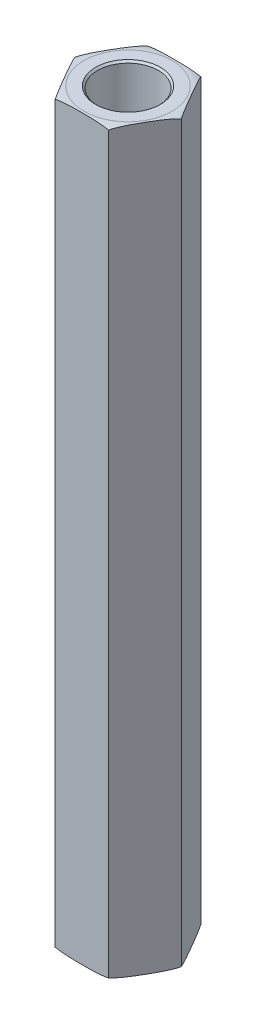
ISO-10303-21;
HEADER;
FILE_DESCRIPTION(('STEP AP214'),'2;1');
FILE_NAME('part.step','',(''),(''),'','','');
FILE_SCHEMA(('AUTOMOTIVE_DESIGN { 1 0 10303 214 1 1 1 1 }'));
ENDSEC;
DATA;
#1=APPLICATION_CONTEXT('core data for automotive mechanical design processes');
#2=APPLICATION_PROTOCOL_DEFINITION('international standard','automotive_design',2000,#1);
#3=PRODUCT_CONTEXT('',#1,'mechanical');
#4=PRODUCT('Part','Part','',(#3));
#5=PRODUCT_RELATED_PRODUCT_CATEGORY('part','',(#4));
#6=PRODUCT_DEFINITION_FORMATION('','',#4);
#7=PRODUCT_DEFINITION_CONTEXT('part definition',#1,'design');
#8=PRODUCT_DEFINITION('design','',#6,#7);
#9=PRODUCT_DEFINITION_SHAPE('','',#8);
#10=(LENGTH_UNIT() NAMED_UNIT(*) SI_UNIT(.MILLI.,.METRE.));
#11=(NAMED_UNIT(*) PLANE_ANGLE_UNIT() SI_UNIT($,.RADIAN.));
#12=(NAMED_UNIT(*) SI_UNIT($,.STERADIAN.) SOLID_ANGLE_UNIT());
#13=UNCERTAINTY_MEASURE_WITH_UNIT(LENGTH_MEASURE(1.E-05),#10,'distance_accuracy_value','');
#14=(GEOMETRIC_REPRESENTATION_CONTEXT(3) GLOBAL_UNCERTAINTY_ASSIGNED_CONTEXT((#13)) GLOBAL_UNIT_ASSIGNED_CONTEXT((#10,
#11,#12)) REPRESENTATION_CONTEXT('',''));
#15=CARTESIAN_POINT('',(0.,0.,0.));
#16=DIRECTION('',(0.,0.,1.));
#17=DIRECTION('',(1.,0.,0.));
#18=AXIS2_PLACEMENT_3D('',#15,#16,#17);
#19=CARTESIAN_POINT('',(0.,12.7,0.));
#20=DIRECTION('',(0.,1.,0.));
#21=DIRECTION('',(0.,0.,1.));
#22=AXIS2_PLACEMENT_3D('',#19,#20,#21);
#23=PLANE('',#22);
#24=CARTESIAN_POINT('',(0.,12.7,0.));
#25=DIRECTION('',(0.,1.,0.));
#26=DIRECTION('',(0.,0.,1.));
#27=AXIS2_PLACEMENT_3D('',#24,#25,#26);
#28=CIRCLE('',#27,2.0955);
#29=CARTESIAN_POINT('',(0.,12.7,2.0955));
#30=VERTEX_POINT('',#29);
#31=EDGE_CURVE('E314',#30,#30,#28,.T.);
#32=ORIENTED_EDGE('',*,*,#31,.T.);
#33=EDGE_LOOP('',(#32));
#34=FACE_BOUND('',#33,.T.);
#35=ADVANCED_FACE('F16',(#34),#23,.T.);
#36=CARTESIAN_POINT('',(0.,-12.7,0.));
#37=DIRECTION('',(0.,-1.,0.));
#38=DIRECTION('',(0.,0.,-1.));
#39=AXIS2_PLACEMENT_3D('',#36,#37,#38);
#40=PLANE('',#39);
#41=CARTESIAN_POINT('',(0.,-12.7,0.));
#42=DIRECTION('',(0.,-1.,0.));
#43=DIRECTION('',(0.,0.,-1.));
#44=AXIS2_PLACEMENT_3D('',#41,#42,#43);
#45=CIRCLE('',#44,2.0955);
#46=CARTESIAN_POINT('',(0.,-12.7,-2.0955));
#47=VERTEX_POINT('',#46);
#48=EDGE_CURVE('E324',#47,#47,#45,.T.);
#49=ORIENTED_EDGE('',*,*,#48,.T.);
#50=EDGE_LOOP('',(#49));
#51=FACE_BOUND('',#50,.T.);
#52=ADVANCED_FACE('F425',(#51),#40,.T.);
#53=CARTESIAN_POINT('',(0.,12.7,0.));
#54=DIRECTION('',(0.,1.,0.));
#55=DIRECTION('',(0.,0.,1.));
#56=AXIS2_PLACEMENT_3D('',#53,#54,#55);
#57=CYLINDRICAL_SURFACE('',#56,2.0955);
#58=CARTESIAN_POINT('',(0.,25.2729999999701,0.));
#59=DIRECTION('',(0.,1.,0.));
#60=DIRECTION('',(0.,0.,1.));
#61=AXIS2_PLACEMENT_3D('',#58,#59,#60);
#62=CIRCLE('',#61,2.09549999993897);
#63=CARTESIAN_POINT('',(0.,25.2729999999701,2.09549999993897));
#64=VERTEX_POINT('',#63);
#65=EDGE_CURVE('E326',#64,#64,#62,.T.);
#66=ORIENTED_EDGE('',*,*,#65,.T.);
#67=EDGE_LOOP('',(#66));
#68=FACE_BOUND('',#67,.T.);
#69=ORIENTED_EDGE('',*,*,#31,.F.);
#70=EDGE_LOOP('',(#69));
#71=FACE_BOUND('',#70,.T.);
#72=ADVANCED_FACE('F336',(#68,#71),#57,.F.);
#73=CARTESIAN_POINT('',(0.,-12.7,0.));
#74=DIRECTION('',(0.,-1.,0.));
#75=DIRECTION('',(0.,0.,-1.));
#76=AXIS2_PLACEMENT_3D('',#73,#74,#75);
#77=CYLINDRICAL_SURFACE('',#76,2.0955);
#78=ORIENTED_EDGE('',*,*,#48,.F.);
#79=EDGE_LOOP('',(#78));
#80=FACE_BOUND('',#79,.T.);
#81=CARTESIAN_POINT('',(0.,-25.2729999999701,0.));
#82=DIRECTION('',(0.,-1.,0.));
#83=DIRECTION('',(0.,0.,-1.));
#84=AXIS2_PLACEMENT_3D('',#81,#82,#83);
#85=CIRCLE('',#84,2.09549999999581);
#86=CARTESIAN_POINT('',(0.,-25.2729999999701,-2.09549999999581));
#87=VERTEX_POINT('',#86);
#88=EDGE_CURVE('E157',#87,#87,#85,.T.);
#89=ORIENTED_EDGE('',*,*,#88,.T.);
#90=EDGE_LOOP('',(#89));
#91=FACE_BOUND('',#90,.T.);
#92=ADVANCED_FACE('F341',(#80,#91),#77,.F.);
#93=CARTESIAN_POINT('',(0.,25.3999999998769,0.));
#94=DIRECTION('',(0.,1.,0.));
#95=DIRECTION('',(-1.,0.,0.));
#96=AXIS2_PLACEMENT_3D('',#93,#94,#95);
#97=CONICAL_SURFACE('',#96,2.2224999998457,0.785398163397448);
#98=CARTESIAN_POINT('',(0.,25.3999999999905,0.));
#99=DIRECTION('',(0.,1.,0.));
#100=DIRECTION('',(-1.,0.,0.));
#101=AXIS2_PLACEMENT_3D('',#98,#99,#100);
#102=CIRCLE('',#101,2.22249999995938);
#103=CARTESIAN_POINT('',(-2.22249999995938,25.3999999999905,0.));
#104=VERTEX_POINT('',#103);
#105=EDGE_CURVE('E79',#104,#104,#102,.T.);
#106=ORIENTED_EDGE('',*,*,#105,.T.);
#107=EDGE_LOOP('',(#106));
#108=FACE_BOUND('',#107,.T.);
#109=ORIENTED_EDGE('',*,*,#65,.F.);
#110=EDGE_LOOP('',(#109));
#111=FACE_BOUND('',#110,.T.);
#112=ADVANCED_FACE('F339',(#108,#111),#97,.F.);
#113=CARTESIAN_POINT('',(-3.66617420935413,25.4,0.));
#114=DIRECTION('',(0.866025403784439,0.,-0.499999999999999));
#115=DIRECTION('',(-0.499999999999999,0.,-0.866025403784439));
#116=AXIS2_PLACEMENT_3D('',#113,#114,#115);
#117=PLANE('',#116);
#118=DIRECTION('',(0.,1.,0.));
#119=VECTOR('',#118,1.);
#120=CARTESIAN_POINT('',(-1.83308710467708,25.4,3.175));
#121=LINE('',#120,#119);
#122=CARTESIAN_POINT('',(-1.83308710467707,-25.273,3.17499999999999));
#123=VERTEX_POINT('',#122);
#124=CARTESIAN_POINT('',(-1.83308710467706,25.273,3.175));
#125=VERTEX_POINT('',#124);
#126=EDGE_CURVE('E75',#123,#125,#121,.T.);
#127=ORIENTED_EDGE('',*,*,#126,.T.);
#128=CARTESIAN_POINT('',(-3.66617420935412,25.273,0.));
#129=CARTESIAN_POINT('',(-3.62797961467395,25.2889014148997,0.0661549785605581));
#130=CARTESIAN_POINT('',(-3.58956810864158,25.3024886076105,0.132685658603871));
#131=CARTESIAN_POINT('',(-3.51249051795712,25.3258161979402,0.266187961794345));
#132=CARTESIAN_POINT('',(-3.47382473049848,25.3355604771397,0.333159070187372));
#133=CARTESIAN_POINT('',(-3.39641631867875,25.3519966530451,0.467234372392355));
#134=CARTESIAN_POINT('',(-3.35767399633315,25.3586945328669,0.534338043098154));
#135=CARTESIAN_POINT('',(-3.28009834620116,25.3697767572932,0.668703010556943));
#136=CARTESIAN_POINT('',(-3.24126499587774,25.374160450474,0.735964346345226));
#137=CARTESIAN_POINT('',(-3.16354065964318,25.3812403004263,0.870586845688048));
#138=CARTESIAN_POINT('',(-3.1246496537448,25.3839355237591,0.937948043861515));
#139=CARTESIAN_POINT('',(-3.04685144594597,25.3881531983713,1.07269849250688));
#140=CARTESIAN_POINT('',(-3.00794424351974,25.3896756080272,1.14008774388949));
#141=CARTESIAN_POINT('',(-2.93051517598878,25.391922705889,1.27419882283578));
#142=CARTESIAN_POINT('',(-2.8919933624894,25.3926552468181,1.34092056101641));
#143=CARTESIAN_POINT('',(-2.81494778346149,25.3935767302574,1.4743674183913));
#144=CARTESIAN_POINT('',(-2.77642401791445,25.3937656658949,1.54109253761765));
#145=CARTESIAN_POINT('',(-2.69935964431019,25.3936659966806,1.67457194815371));
#146=CARTESIAN_POINT('',(-2.66081903631828,25.3933771811766,1.74132623935029));
#147=CARTESIAN_POINT('',(-2.58373908085337,25.392221986219,1.87483263846066));
#148=CARTESIAN_POINT('',(-2.54519973341253,25.3913555970386,1.94158474631875));
#149=CARTESIAN_POINT('',(-2.46812969629779,25.3887861940656,2.0750739663427));
#150=CARTESIAN_POINT('',(-2.42959900625973,25.3870832271617,2.1418110791393));
#151=CARTESIAN_POINT('',(-2.35255651340917,25.3824387229726,2.27525259109823));
#152=CARTESIAN_POINT('',(-2.31404470975451,25.3794972471358,2.34195699171921));
#153=CARTESIAN_POINT('',(-2.25084206239953,25.3732174124749,2.4514271881109));
#154=CARTESIAN_POINT('',(-2.22613849337018,25.3703980110463,2.49421502479802));
#155=CARTESIAN_POINT('',(-2.17676945272235,25.3638696794304,2.579724711521));
#156=CARTESIAN_POINT('',(-2.1521039703419,25.3601610809139,2.62244658019713));
#157=CARTESIAN_POINT('',(-2.10282753811702,25.3516802711497,2.70779586442636));
#158=CARTESIAN_POINT('',(-2.07821657107534,25.3469084657009,2.75042330976594));
#159=CARTESIAN_POINT('',(-2.02900094683554,25.3360987712516,2.83566727147549));
#160=CARTESIAN_POINT('',(-2.00439646085467,25.3300577313084,2.87828349128847));
#161=CARTESIAN_POINT('',(-1.95527325900936,25.3165138354161,2.96336737271501));
#162=CARTESIAN_POINT('',(-1.93075459617617,25.309010197803,3.00583494247576));
#163=CARTESIAN_POINT('',(-1.88182157373173,25.2923203507084,3.09058942351743));
#164=CARTESIAN_POINT('',(-1.85740744053271,25.2831314978033,3.13287594264089));
#165=CARTESIAN_POINT('',(-1.83308710467707,25.273,3.175));
#166=B_SPLINE_CURVE_WITH_KNOTS('',3,(#128,#129,#130,#131,#132,#133,#134,#135,#136,#137,#138,
#139,#140,#141,#142,#143,#144,#145,#146,#147,#148,#149,#150,#151,#152,#153,#154,#155,#156,#157,
#158,#159,#160,#161,#162,#163,#164,#165),.UNSPECIFIED.,.F.,.F.,(4,2,2,2,2,2,2,2,2,2,2,2,2,2,2,2,
2,2,4),(0.,0.233977307817926,0.467717675040663,0.700996973557454,0.934341903229689,
1.16781571967232,1.40129782179815,1.63243665809659,1.86357841666605,2.09482211846281,
2.3260697147148,2.55730435147381,2.78852751694395,2.93698369265072,3.08538458004461,
3.23372892334575,3.38244598546606,3.5312427462608,3.68027493713584),.UNSPECIFIED.);
#167=CARTESIAN_POINT('',(-3.66617420935412,25.273,0.));
#168=VERTEX_POINT('',#167);
#169=EDGE_CURVE('E68',#168,#125,#166,.T.);
#170=ORIENTED_EDGE('',*,*,#169,.F.);
#171=DIRECTION('',(0.,1.,0.));
#172=VECTOR('',#171,1.);
#173=CARTESIAN_POINT('',(-3.66617420935413,25.4,0.));
#174=LINE('',#173,#172);
#175=CARTESIAN_POINT('',(-3.66617420935413,-25.273,0.));
#176=VERTEX_POINT('',#175);
#177=EDGE_CURVE('E72',#168,#176,#174,.F.);
#178=ORIENTED_EDGE('',*,*,#177,.T.);
#179=CARTESIAN_POINT('',(-1.83308710467707,-25.273,3.17499999999999));
#180=CARTESIAN_POINT('',(-1.87128169935724,-25.2889014148997,3.10884502143944));
#181=CARTESIAN_POINT('',(-1.90969320538962,-25.3024886076105,3.04231434139612));
#182=CARTESIAN_POINT('',(-1.98677079607407,-25.3258161979402,2.90881203820565));
#183=CARTESIAN_POINT('',(-2.02543658353272,-25.3355604771397,2.84184092981262));
#184=CARTESIAN_POINT('',(-2.10284499535244,-25.3519966530451,2.70776562760764));
#185=CARTESIAN_POINT('',(-2.14158731769805,-25.3586945328669,2.64066195690184));
#186=CARTESIAN_POINT('',(-2.21916296783003,-25.3697767572932,2.50629698944305));
#187=CARTESIAN_POINT('',(-2.25799631815345,-25.374160450474,2.43903565365477));
#188=CARTESIAN_POINT('',(-2.33572065438801,-25.3812403004263,2.30441315431195));
#189=CARTESIAN_POINT('',(-2.3746116602864,-25.3839355237591,2.23705195613848));
#190=CARTESIAN_POINT('',(-2.45240986808522,-25.3881531983713,2.10230150749311));
#191=CARTESIAN_POINT('',(-2.49131707051146,-25.3896756080272,2.03491225611051));
#192=CARTESIAN_POINT('',(-2.56874613804241,-25.391922705889,1.90080117716421));
#193=CARTESIAN_POINT('',(-2.6072679515418,-25.3926552468181,1.83407943898358));
#194=CARTESIAN_POINT('',(-2.6843135305697,-25.3935767302574,1.70063258160869));
#195=CARTESIAN_POINT('',(-2.72283729611674,-25.3937656658949,1.63390746238234));
#196=CARTESIAN_POINT('',(-2.79990166972101,-25.3936659966806,1.50042805184629));
#197=CARTESIAN_POINT('',(-2.83844227771291,-25.3933771811766,1.43367376064971));
#198=CARTESIAN_POINT('',(-2.91552223317783,-25.392221986219,1.30016736153933));
#199=CARTESIAN_POINT('',(-2.95406158061867,-25.3913555970386,1.23341525368124));
#200=CARTESIAN_POINT('',(-3.03113161773341,-25.3887861940656,1.09992603365729));
#201=CARTESIAN_POINT('',(-3.06966230777146,-25.3870832271617,1.0331889208607));
#202=CARTESIAN_POINT('',(-3.14670480062202,-25.3824387229726,0.899747408901762));
#203=CARTESIAN_POINT('',(-3.18521660427668,-25.3794972471358,0.83304300828078));
#204=CARTESIAN_POINT('',(-3.24841925163166,-25.3732174124749,0.723572811889093));
#205=CARTESIAN_POINT('',(-3.27312282066101,-25.3703980110463,0.68078497520197));
#206=CARTESIAN_POINT('',(-3.32249186130884,-25.3638696794304,0.595275288478995));
#207=CARTESIAN_POINT('',(-3.34715734368929,-25.3601610809139,0.552553419802863));
#208=CARTESIAN_POINT('',(-3.39643377591418,-25.3516802711497,0.467204135573639));
#209=CARTESIAN_POINT('',(-3.42104474295585,-25.3469084657009,0.424576690234056));
#210=CARTESIAN_POINT('',(-3.47026036719565,-25.3360987712516,0.3393327285245));
#211=CARTESIAN_POINT('',(-3.49486485317652,-25.3300577313084,0.296716508711522));
#212=CARTESIAN_POINT('',(-3.54398805502183,-25.3165138354161,0.211632627284986));
#213=CARTESIAN_POINT('',(-3.56850671785503,-25.309010197803,0.169165057524237));
#214=CARTESIAN_POINT('',(-3.61743974029946,-25.2923203507084,0.0844105764825622));
#215=CARTESIAN_POINT('',(-3.64185387349848,-25.2831314978033,0.0421240573591058));
#216=CARTESIAN_POINT('',(-3.66617420935413,-25.273,0.));
#217=B_SPLINE_CURVE_WITH_KNOTS('',3,(#179,#180,#181,#182,#183,#184,#185,#186,#187,#188,#189,
#190,#191,#192,#193,#194,#195,#196,#197,#198,#199,#200,#201,#202,#203,#204,#205,#206,#207,#208,
#209,#210,#211,#212,#213,#214,#215,#216),.UNSPECIFIED.,.F.,.F.,(4,2,2,2,2,2,2,2,2,2,2,2,2,2,2,2,
2,2,4),(0.,0.233977307817926,0.467717675040663,0.700996973557454,0.934341903229688,
1.16781571967232,1.40129782179815,1.63243665809659,1.86357841666605,2.0948221184628,
2.3260697147148,2.55730435147381,2.78852751694395,2.93698369265072,3.08538458004461,
3.23372892334575,3.38244598546606,3.5312427462608,3.68027493713584),.UNSPECIFIED.);
#218=EDGE_CURVE('E87',#123,#176,#217,.T.);
#219=ORIENTED_EDGE('',*,*,#218,.F.);
#220=EDGE_LOOP('',(#127,#170,#178,#219));
#221=FACE_BOUND('',#220,.T.);
#222=ADVANCED_FACE('F70',(#221),#117,.F.);
#223=CARTESIAN_POINT('',(0.,-25.3999999998769,0.));
#224=DIRECTION('',(0.,-1.,0.));
#225=DIRECTION('',(1.,0.,0.));
#226=AXIS2_PLACEMENT_3D('',#223,#224,#225);
#227=CONICAL_SURFACE('',#226,2.22249999990254,0.785398163173655);
#228=ORIENTED_EDGE('',*,*,#88,.F.);
#229=EDGE_LOOP('',(#228));
#230=FACE_BOUND('',#229,.T.);
#231=CARTESIAN_POINT('',(0.,-25.3999999999337,0.));
#232=DIRECTION('',(0.,-1.,0.));
#233=DIRECTION('',(1.,0.,0.));
#234=AXIS2_PLACEMENT_3D('',#231,#232,#233);
#235=CIRCLE('',#234,2.22249999995938);
#236=CARTESIAN_POINT('',(2.22249999995938,-25.3999999999337,0.));
#237=VERTEX_POINT('',#236);
#238=EDGE_CURVE('E289',#237,#237,#235,.F.);
#239=ORIENTED_EDGE('',*,*,#238,.F.);
#240=EDGE_LOOP('',(#239));
#241=FACE_BOUND('',#240,.T.);
#242=ADVANCED_FACE('F348',(#230,#241),#227,.F.);
#243=CARTESIAN_POINT('',(-1.83308710467707,25.4,-3.175));
#244=DIRECTION('',(0.,-1.,0.));
#245=DIRECTION('',(0.,0.,-1.));
#246=AXIS2_PLACEMENT_3D('',#243,#244,#245);
#247=PLANE('',#246);
#248=CARTESIAN_POINT('',(0.,25.4,0.));
#249=DIRECTION('',(0.,-1.,0.));
#250=DIRECTION('',(0.,0.,1.));
#251=AXIS2_PLACEMENT_3D('',#248,#249,#250);
#252=CIRCLE('',#251,3.03117420935412);
#253=CARTESIAN_POINT('',(0.,25.4,3.03117420935412));
#254=VERTEX_POINT('',#253);
#255=CARTESIAN_POINT('',(0.,25.4,-3.03117420935412));
#256=VERTEX_POINT('',#255);
#257=EDGE_CURVE('E78',#254,#256,#252,.T.);
#258=ORIENTED_EDGE('',*,*,#257,.F.);
#259=CARTESIAN_POINT('',(0.,25.4,0.));
#260=DIRECTION('',(0.,-1.,0.));
#261=DIRECTION('',(0.,0.,-1.));
#262=AXIS2_PLACEMENT_3D('',#259,#260,#261);
#263=CIRCLE('',#262,3.03117420935412);
#264=EDGE_CURVE('E142',#256,#254,#263,.T.);
#265=ORIENTED_EDGE('',*,*,#264,.F.);
#266=EDGE_LOOP('',(#258,#265));
#267=FACE_BOUND('',#266,.T.);
#268=ORIENTED_EDGE('',*,*,#105,.F.);
#269=EDGE_LOOP('',(#268));
#270=FACE_BOUND('',#269,.T.);
#271=ADVANCED_FACE('F118',(#267,#270),#247,.F.);
#272=CARTESIAN_POINT('',(-1.83308710467707,25.4,-3.175));
#273=DIRECTION('',(0.866025403784439,0.,0.5));
#274=DIRECTION('',(0.5,0.,-0.866025403784439));
#275=AXIS2_PLACEMENT_3D('',#272,#273,#274);
#276=PLANE('',#275);
#277=ORIENTED_EDGE('',*,*,#177,.F.);
#278=CARTESIAN_POINT('',(-1.83308710467706,25.273,-3.17500000000001));
#279=CARTESIAN_POINT('',(-1.87128169935723,25.2889014148997,-3.10884502143946));
#280=CARTESIAN_POINT('',(-1.9096932053896,25.3024886076105,-3.04231434139615));
#281=CARTESIAN_POINT('',(-1.98677079607406,25.3258161979402,-2.90881203820568));
#282=CARTESIAN_POINT('',(-2.0254365835327,25.3355604771397,-2.84184092981265));
#283=CARTESIAN_POINT('',(-2.10284499535242,25.3519966530451,-2.70776562760767));
#284=CARTESIAN_POINT('',(-2.14158731769803,25.3586945328669,-2.64066195690188));
#285=CARTESIAN_POINT('',(-2.21916296783001,25.3697767572932,-2.50629698944309));
#286=CARTESIAN_POINT('',(-2.25799631815343,25.374160450474,-2.43903565365481));
#287=CARTESIAN_POINT('',(-2.33572065438799,25.3812403004263,-2.30441315431199));
#288=CARTESIAN_POINT('',(-2.37461166028637,25.3839355237591,-2.23705195613853));
#289=CARTESIAN_POINT('',(-2.45240986808519,25.3881531983713,-2.10230150749317));
#290=CARTESIAN_POINT('',(-2.49131707051143,25.3896756080272,-2.03491225611056));
#291=CARTESIAN_POINT('',(-2.56874613804238,25.391922705889,-1.90080117716427));
#292=CARTESIAN_POINT('',(-2.60726795154177,25.3926552468181,-1.83407943898364));
#293=CARTESIAN_POINT('',(-2.68431353056967,25.3935767302574,-1.70063258160875));
#294=CARTESIAN_POINT('',(-2.72283729611671,25.3937656658949,-1.63390746238241));
#295=CARTESIAN_POINT('',(-2.79990166972097,25.3936659966806,-1.50042805184636));
#296=CARTESIAN_POINT('',(-2.83844227771288,25.3933771811766,-1.43367376064978));
#297=CARTESIAN_POINT('',(-2.91552223317778,25.392221986219,-1.30016736153941));
#298=CARTESIAN_POINT('',(-2.95406158061863,25.3913555970386,-1.23341525368132));
#299=CARTESIAN_POINT('',(-3.03113161773337,25.3887861940656,-1.09992603365738));
#300=CARTESIAN_POINT('',(-3.06966230777142,25.3870832271617,-1.03318892086078));
#301=CARTESIAN_POINT('',(-3.14670480062198,25.3824387229726,-0.899747408901851));
#302=CARTESIAN_POINT('',(-3.18521660427663,25.3794972471358,-0.83304300828087));
#303=CARTESIAN_POINT('',(-3.24841925163161,25.3732174124749,-0.723572811889181));
#304=CARTESIAN_POINT('',(-3.27312282066097,25.3703980110463,-0.680784975202054));
#305=CARTESIAN_POINT('',(-3.32249186130881,25.3638696794304,-0.595275288479069));
#306=CARTESIAN_POINT('',(-3.34715734368926,25.3601610809139,-0.552553419802932));
#307=CARTESIAN_POINT('',(-3.39643377591415,25.3516802711497,-0.467204135573698));
#308=CARTESIAN_POINT('',(-3.42104474295582,25.3469084657009,-0.42457669023411));
#309=CARTESIAN_POINT('',(-3.47026036719563,25.3360987712516,-0.339332728524545));
#310=CARTESIAN_POINT('',(-3.4948648531765,25.3300577313084,-0.296716508711561));
#311=CARTESIAN_POINT('',(-3.54398805502182,25.3165138354161,-0.211632627285015));
#312=CARTESIAN_POINT('',(-3.56850671785502,25.309010197803,-0.169165057524262));
#313=CARTESIAN_POINT('',(-3.61743974029946,25.2923203507084,-0.0844105764825773));
#314=CARTESIAN_POINT('',(-3.64185387349848,25.2831314978033,-0.0421240573591159));
#315=CARTESIAN_POINT('',(-3.66617420935413,25.273,0.));
#316=B_SPLINE_CURVE_WITH_KNOTS('',3,(#278,#279,#280,#281,#282,#283,#284,#285,#286,#287,#288,
#289,#290,#291,#292,#293,#294,#295,#296,#297,#298,#299,#300,#301,#302,#303,#304,#305,#306,#307,
#308,#309,#310,#311,#312,#313,#314,#315),.UNSPECIFIED.,.F.,.F.,(4,2,2,2,2,2,2,2,2,2,2,2,2,2,2,2,
2,2,4),(0.,0.23397730781792,0.46771767504065,0.700996973557435,0.934341903229662,
1.16781571967229,1.40129782179811,1.63243665809654,1.86357841666599,2.09482211846275,
2.32606971471473,2.55730435147374,2.78852751694387,2.93698369265066,3.08538458004457,
3.23372892334572,3.38244598546605,3.53124274626081,3.68027493713587),.UNSPECIFIED.);
#317=CARTESIAN_POINT('',(-1.83308710467705,25.273,-3.17500000000001));
#318=VERTEX_POINT('',#317);
#319=EDGE_CURVE('E84',#318,#168,#316,.T.);
#320=ORIENTED_EDGE('',*,*,#319,.F.);
#321=DIRECTION('',(0.,1.,0.));
#322=VECTOR('',#321,1.);
#323=CARTESIAN_POINT('',(-1.83308710467704,25.4,-3.175));
#324=LINE('',#323,#322);
#325=CARTESIAN_POINT('',(-1.83308710467707,-25.273,-3.175));
#326=VERTEX_POINT('',#325);
#327=EDGE_CURVE('E180',#318,#326,#324,.F.);
#328=ORIENTED_EDGE('',*,*,#327,.T.);
#329=CARTESIAN_POINT('',(-3.66617420935413,-25.273,0.));
#330=CARTESIAN_POINT('',(-3.62797961467396,-25.2889014148997,-0.0661549785605592));
#331=CARTESIAN_POINT('',(-3.58956810864158,-25.3024886076105,-0.132685658603871));
#332=CARTESIAN_POINT('',(-3.51249051795713,-25.3258161979402,-0.266187961794346));
#333=CARTESIAN_POINT('',(-3.47382473049848,-25.3355604771397,-0.333159070187372));
#334=CARTESIAN_POINT('',(-3.39641631867876,-25.3519966530451,-0.467234372392354));
#335=CARTESIAN_POINT('',(-3.35767399633315,-25.3586945328669,-0.534338043098152));
#336=CARTESIAN_POINT('',(-3.28009834620117,-25.3697767572932,-0.66870301055694));
#337=CARTESIAN_POINT('',(-3.24126499587775,-25.374160450474,-0.735964346345222));
#338=CARTESIAN_POINT('',(-3.16354065964319,-25.3812403004263,-0.870586845688043));
#339=CARTESIAN_POINT('',(-3.1246496537448,-25.3839355237591,-0.937948043861509));
#340=CARTESIAN_POINT('',(-3.04685144594598,-25.3881531983713,-1.07269849250688));
#341=CARTESIAN_POINT('',(-3.00794424351975,-25.3896756080272,-1.14008774388948));
#342=CARTESIAN_POINT('',(-2.93051517598879,-25.391922705889,-1.27419882283578));
#343=CARTESIAN_POINT('',(-2.8919933624894,-25.3926552468181,-1.3409205610164));
#344=CARTESIAN_POINT('',(-2.8149477834615,-25.3935767302574,-1.4743674183913));
#345=CARTESIAN_POINT('',(-2.77642401791446,-25.3937656658949,-1.54109253761764));
#346=CARTESIAN_POINT('',(-2.6993596443102,-25.3936659966806,-1.6745719481537));
#347=CARTESIAN_POINT('',(-2.66081903631829,-25.3933771811766,-1.74132623935028));
#348=CARTESIAN_POINT('',(-2.58373908085338,-25.392221986219,-1.87483263846065));
#349=CARTESIAN_POINT('',(-2.54519973341254,-25.3913555970386,-1.94158474631874));
#350=CARTESIAN_POINT('',(-2.4681296962978,-25.3887861940656,-2.07507396634269));
#351=CARTESIAN_POINT('',(-2.42959900625974,-25.3870832271617,-2.14181107913928));
#352=CARTESIAN_POINT('',(-2.35255651340918,-25.3824387229726,-2.27525259109822));
#353=CARTESIAN_POINT('',(-2.31404470975452,-25.3794972471358,-2.3419569917192));
#354=CARTESIAN_POINT('',(-2.25084206239954,-25.3732174124749,-2.45142718811088));
#355=CARTESIAN_POINT('',(-2.22613849337019,-25.3703980110463,-2.49421502479801));
#356=CARTESIAN_POINT('',(-2.17676945272236,-25.3638696794304,-2.57972471152098));
#357=CARTESIAN_POINT('',(-2.15210397034191,-25.3601610809139,-2.62244658019712));
#358=CARTESIAN_POINT('',(-2.10282753811703,-25.3516802711497,-2.70779586442634));
#359=CARTESIAN_POINT('',(-2.07821657107535,-25.3469084657009,-2.75042330976592));
#360=CARTESIAN_POINT('',(-2.02900094683555,-25.3360987712516,-2.83566727147548));
#361=CARTESIAN_POINT('',(-2.00439646085468,-25.3300577313084,-2.87828349128846));
#362=CARTESIAN_POINT('',(-1.95527325900937,-25.3165138354161,-2.963367372715));
#363=CARTESIAN_POINT('',(-1.93075459617617,-25.309010197803,-3.00583494247575));
#364=CARTESIAN_POINT('',(-1.88182157373174,-25.2923203507084,-3.09058942351742));
#365=CARTESIAN_POINT('',(-1.85740744053272,-25.2831314978033,-3.13287594264088));
#366=CARTESIAN_POINT('',(-1.83308710467707,-25.273,-3.17499999999999));
#367=B_SPLINE_CURVE_WITH_KNOTS('',3,(#329,#330,#331,#332,#333,#334,#335,#336,#337,#338,#339,
#340,#341,#342,#343,#344,#345,#346,#347,#348,#349,#350,#351,#352,#353,#354,#355,#356,#357,#358,
#359,#360,#361,#362,#363,#364,#365,#366),.UNSPECIFIED.,.F.,.F.,(4,2,2,2,2,2,2,2,2,2,2,2,2,2,2,2,
2,2,4),(0.,0.233977307817925,0.467717675040661,0.700996973557449,0.934341903229682,
1.16781571967231,1.40129782179814,1.63243665809658,1.86357841666603,2.09482211846279,
2.32606971471478,2.55730435147379,2.78852751694393,2.9369836926507,3.0853845800446,
3.23372892334574,3.38244598546605,3.53124274626079,3.68027493713583),.UNSPECIFIED.);
#368=EDGE_CURVE('E86',#176,#326,#367,.T.);
#369=ORIENTED_EDGE('',*,*,#368,.F.);
#370=EDGE_LOOP('',(#277,#320,#328,#369));
#371=FACE_BOUND('',#370,.T.);
#372=ADVANCED_FACE('F82',(#371),#276,.F.);
#373=CARTESIAN_POINT('',(-1.83308710467707,25.4,3.175));
#374=DIRECTION('',(0.,0.,-1.));
#375=DIRECTION('',(-1.,0.,0.));
#376=AXIS2_PLACEMENT_3D('',#373,#374,#375);
#377=PLANE('',#376);
#378=DIRECTION('',(0.,1.,0.));
#379=VECTOR('',#378,1.);
#380=CARTESIAN_POINT('',(1.83308710467706,25.4,3.17499999999999));
#381=LINE('',#380,#379);
#382=CARTESIAN_POINT('',(1.83308710467706,-25.273,3.17499999999999));
#383=VERTEX_POINT('',#382);
#384=CARTESIAN_POINT('',(1.83308710467706,25.273,3.17499999999999));
#385=VERTEX_POINT('',#384);
#386=EDGE_CURVE('E182',#383,#385,#381,.T.);
#387=ORIENTED_EDGE('',*,*,#386,.T.);
#388=CARTESIAN_POINT('',(-1.83308710467706,25.273,3.175));
#389=CARTESIAN_POINT('',(-1.73237579828683,25.2939400141518,3.175));
#390=CARTESIAN_POINT('',(-1.63096506893486,25.3108853495327,3.175));
#391=CARTESIAN_POINT('',(-1.42767146651469,25.3384971643984,3.175));
#392=CARTESIAN_POINT('',(-1.32579191427254,25.3491875658753,3.175));
#393=CARTESIAN_POINT('',(-1.12177634709138,25.3661280408079,3.175));
#394=CARTESIAN_POINT('',(-1.0196405664338,25.3723812707189,3.175));
#395=CARTESIAN_POINT('',(-0.815663681397376,25.3819028064183,3.175));
#396=CARTESIAN_POINT('',(-0.713823115514574,25.3851834044999,3.175));
#397=CARTESIAN_POINT('',(-0.510018485441651,25.3899454848703,3.175));
#398=CARTESIAN_POINT('',(-0.408054390577977,25.3914254100882,3.175));
#399=CARTESIAN_POINT('',(-0.204060200337871,25.3933146818379,3.175));
#400=CARTESIAN_POINT('',(-0.102030100168935,25.3937234241492,3.175));
#401=CARTESIAN_POINT('',(0.102030100168936,25.3937234241492,3.175));
#402=CARTESIAN_POINT('',(0.204060200337871,25.3933146818379,3.175));
#403=CARTESIAN_POINT('',(0.408054390577978,25.3914254100882,3.17499999999999));
#404=CARTESIAN_POINT('',(0.510018485441653,25.3899454848703,3.17499999999999));
#405=CARTESIAN_POINT('',(0.713823115514575,25.3851834044999,3.17499999999999));
#406=CARTESIAN_POINT('',(0.815663681397378,25.3819028064183,3.17499999999999));
#407=CARTESIAN_POINT('',(1.0196405664338,25.3723812707189,3.17499999999999));
#408=CARTESIAN_POINT('',(1.12177634709138,25.3661280408079,3.17499999999999));
#409=CARTESIAN_POINT('',(1.32579191427254,25.3491875658753,3.17499999999999));
#410=CARTESIAN_POINT('',(1.42767146651469,25.3384971643984,3.17499999999999));
#411=CARTESIAN_POINT('',(1.63096506893486,25.3108853495327,3.17499999999999));
#412=CARTESIAN_POINT('',(1.73237579828684,25.2939400141518,3.17499999999999));
#413=CARTESIAN_POINT('',(1.83308710467706,25.273,3.17499999999999));
#414=B_SPLINE_CURVE_WITH_KNOTS('',3,(#388,#389,#390,#391,#392,#393,#394,#395,#396,#397,#398,
#399,#400,#401,#402,#403,#404,#405,#406,#407,#408,#409,#410,#411,#412,#413),.UNSPECIFIED.,.F.,
.F.,(4,2,2,2,2,2,2,2,2,2,2,2,4),(0.,0.308333242342808,0.615479423308236,0.92240689113001,
1.2280592962085,1.53397581645216,1.84006485747889,2.14615389850562,2.45207041874928,
2.75772282382777,3.06465029164954,3.37179647261497,3.68012971495778),.UNSPECIFIED.);
#415=EDGE_CURVE('E283',#125,#385,#414,.T.);
#416=ORIENTED_EDGE('',*,*,#415,.F.);
#417=ORIENTED_EDGE('',*,*,#126,.F.);
#418=CARTESIAN_POINT('',(1.83308710467706,-25.273,3.17499999999999));
#419=CARTESIAN_POINT('',(1.73237579828684,-25.2939400141518,3.17499999999999));
#420=CARTESIAN_POINT('',(1.63096506893486,-25.3108853495327,3.17499999999999));
#421=CARTESIAN_POINT('',(1.4276714665147,-25.3384971643984,3.17499999999999));
#422=CARTESIAN_POINT('',(1.32579191427254,-25.3491875658753,3.17499999999999));
#423=CARTESIAN_POINT('',(1.12177634709138,-25.3661280408079,3.17499999999999));
#424=CARTESIAN_POINT('',(1.0196405664338,-25.3723812707189,3.17499999999999));
#425=CARTESIAN_POINT('',(0.815663681397379,-25.3819028064183,3.17499999999999));
#426=CARTESIAN_POINT('',(0.713823115514576,-25.3851834044999,3.17499999999999));
#427=CARTESIAN_POINT('',(0.510018485441653,-25.3899454848703,3.17499999999999));
#428=CARTESIAN_POINT('',(0.408054390577978,-25.3914254100882,3.17499999999999));
#429=CARTESIAN_POINT('',(0.204060200337871,-25.3933146818379,3.175));
#430=CARTESIAN_POINT('',(0.102030100168936,-25.3937234241492,3.175));
#431=CARTESIAN_POINT('',(-0.102030100168936,-25.3937234241492,3.175));
#432=CARTESIAN_POINT('',(-0.204060200337872,-25.3933146818379,3.175));
#433=CARTESIAN_POINT('',(-0.408054390577981,-25.3914254100882,3.175));
#434=CARTESIAN_POINT('',(-0.510018485441656,-25.3899454848703,3.175));
#435=CARTESIAN_POINT('',(-0.71382311551458,-25.3851834044999,3.175));
#436=CARTESIAN_POINT('',(-0.815663681397384,-25.3819028064183,3.175));
#437=CARTESIAN_POINT('',(-1.01964056643381,-25.3723812707189,3.175));
#438=CARTESIAN_POINT('',(-1.12177634709139,-25.3661280408079,3.175));
#439=CARTESIAN_POINT('',(-1.32579191427255,-25.3491875658753,3.175));
#440=CARTESIAN_POINT('',(-1.4276714665147,-25.3384971643984,3.175));
#441=CARTESIAN_POINT('',(-1.63096506893487,-25.3108853495327,3.175));
#442=CARTESIAN_POINT('',(-1.73237579828685,-25.2939400141518,3.175));
#443=CARTESIAN_POINT('',(-1.83308710467708,-25.273,3.175));
#444=B_SPLINE_CURVE_WITH_KNOTS('',3,(#418,#419,#420,#421,#422,#423,#424,#425,#426,#427,#428,
#429,#430,#431,#432,#433,#434,#435,#436,#437,#438,#439,#440,#441,#442,#443),.UNSPECIFIED.,.F.,
.F.,(4,2,2,2,2,2,2,2,2,2,2,2,4),(0.,0.308333242342808,0.615479423308238,0.922406891130012,
1.22805929620851,1.53397581645217,1.84006485747889,2.14615389850562,2.45207041874929,
2.75772282382778,3.06465029164956,3.37179647261499,3.6801297149578),.UNSPECIFIED.);
#445=EDGE_CURVE('E255',#383,#123,#444,.T.);
#446=ORIENTED_EDGE('',*,*,#445,.F.);
#447=EDGE_LOOP('',(#387,#416,#417,#446));
#448=FACE_BOUND('',#447,.T.);
#449=ADVANCED_FACE('F206',(#448),#377,.F.);
#450=CARTESIAN_POINT('',(-1.83308710467707,-25.4,-3.175));
#451=DIRECTION('',(0.,-1.,0.));
#452=DIRECTION('',(0.,0.,-1.));
#453=AXIS2_PLACEMENT_3D('',#450,#451,#452);
#454=PLANE('',#453);
#455=CARTESIAN_POINT('',(0.,-25.4,0.));
#456=DIRECTION('',(0.,1.,0.));
#457=DIRECTION('',(0.,0.,1.));
#458=AXIS2_PLACEMENT_3D('',#455,#456,#457);
#459=CIRCLE('',#458,3.03117420935413);
#460=CARTESIAN_POINT('',(0.,-25.4,3.03117420935412));
#461=VERTEX_POINT('',#460);
#462=CARTESIAN_POINT('',(0.,-25.4,-3.03117420935412));
#463=VERTEX_POINT('',#462);
#464=EDGE_CURVE('E192',#461,#463,#459,.T.);
#465=ORIENTED_EDGE('',*,*,#464,.F.);
#466=CARTESIAN_POINT('',(0.,-25.4,0.));
#467=DIRECTION('',(0.,1.,0.));
#468=DIRECTION('',(0.,0.,-1.));
#469=AXIS2_PLACEMENT_3D('',#466,#467,#468);
#470=CIRCLE('',#469,3.03117420935413);
#471=EDGE_CURVE('E185',#461,#463,#470,.F.);
#472=ORIENTED_EDGE('',*,*,#471,.T.);
#473=EDGE_LOOP('',(#465,#472));
#474=FACE_BOUND('',#473,.T.);
#475=ORIENTED_EDGE('',*,*,#238,.T.);
#476=EDGE_LOOP('',(#475));
#477=FACE_BOUND('',#476,.T.);
#478=ADVANCED_FACE('F197',(#474,#477),#454,.T.);
#479=CARTESIAN_POINT('',(1.83308710467706,25.4,3.17499999999999));
#480=DIRECTION('',(-0.866025403784439,0.,-0.5));
#481=DIRECTION('',(-0.5,0.,0.866025403784439));
#482=AXIS2_PLACEMENT_3D('',#479,#480,#481);
#483=PLANE('',#482);
#484=DIRECTION('',(0.,1.,0.));
#485=VECTOR('',#484,1.);
#486=CARTESIAN_POINT('',(3.66617420935412,25.4,0.));
#487=LINE('',#486,#485);
#488=CARTESIAN_POINT('',(3.66617420935412,-25.273,0.));
#489=VERTEX_POINT('',#488);
#490=CARTESIAN_POINT('',(3.66617420935412,25.273,0.));
#491=VERTEX_POINT('',#490);
#492=EDGE_CURVE('E238',#489,#491,#487,.T.);
#493=ORIENTED_EDGE('',*,*,#492,.T.);
#494=CARTESIAN_POINT('',(1.83308710467706,25.273,3.17499999999999));
#495=CARTESIAN_POINT('',(1.87128169935723,25.2889014148997,3.10884502143944));
#496=CARTESIAN_POINT('',(1.90969320538961,25.3024886076105,3.04231434139613));
#497=CARTESIAN_POINT('',(1.98677079607406,25.3258161979402,2.90881203820565));
#498=CARTESIAN_POINT('',(2.02543658353271,25.3355604771397,2.84184092981262));
#499=CARTESIAN_POINT('',(2.10284499535243,25.3519966530451,2.70776562760764));
#500=CARTESIAN_POINT('',(2.14158731769804,25.3586945328669,2.64066195690184));
#501=CARTESIAN_POINT('',(2.21916296783003,25.3697767572932,2.50629698944305));
#502=CARTESIAN_POINT('',(2.25799631815344,25.374160450474,2.43903565365477));
#503=CARTESIAN_POINT('',(2.335720654388,25.3812403004263,2.30441315431195));
#504=CARTESIAN_POINT('',(2.37461166028639,25.3839355237591,2.23705195613848));
#505=CARTESIAN_POINT('',(2.45240986808522,25.3881531983713,2.10230150749311));
#506=CARTESIAN_POINT('',(2.49131707051145,25.3896756080272,2.03491225611051));
#507=CARTESIAN_POINT('',(2.56874613804241,25.391922705889,1.90080117716421));
#508=CARTESIAN_POINT('',(2.60726795154179,25.3926552468181,1.83407943898358));
#509=CARTESIAN_POINT('',(2.6843135305697,25.3935767302574,1.70063258160869));
#510=CARTESIAN_POINT('',(2.72283729611674,25.3937656658949,1.63390746238234));
#511=CARTESIAN_POINT('',(2.799901669721,25.3936659966806,1.50042805184629));
#512=CARTESIAN_POINT('',(2.83844227771291,25.3933771811766,1.43367376064971));
#513=CARTESIAN_POINT('',(2.91552223317782,25.392221986219,1.30016736153933));
#514=CARTESIAN_POINT('',(2.95406158061866,25.3913555970386,1.23341525368124));
#515=CARTESIAN_POINT('',(3.0311316177334,25.3887861940656,1.09992603365729));
#516=CARTESIAN_POINT('',(3.06966230777146,25.3870832271617,1.0331889208607));
#517=CARTESIAN_POINT('',(3.14670480062202,25.3824387229726,0.899747408901762));
#518=CARTESIAN_POINT('',(3.18521660427668,25.3794972471358,0.833043008280781));
#519=CARTESIAN_POINT('',(3.24841925163166,25.3732174124749,0.723572811889094));
#520=CARTESIAN_POINT('',(3.27312282066101,25.3703980110463,0.680784975201971));
#521=CARTESIAN_POINT('',(3.32249186130884,25.3638696794304,0.595275288478997));
#522=CARTESIAN_POINT('',(3.34715734368929,25.3601610809139,0.552553419802865));
#523=CARTESIAN_POINT('',(3.39643377591417,25.3516802711497,0.467204135573642));
#524=CARTESIAN_POINT('',(3.42104474295585,25.3469084657009,0.424576690234059));
#525=CARTESIAN_POINT('',(3.47026036719565,25.3360987712516,0.339332728524504));
#526=CARTESIAN_POINT('',(3.49486485317651,25.3300577313084,0.296716508711526));
#527=CARTESIAN_POINT('',(3.54398805502182,25.3165138354161,0.21163262728499));
#528=CARTESIAN_POINT('',(3.56850671785502,25.309010197803,0.169165057524242));
#529=CARTESIAN_POINT('',(3.61743974029946,25.2923203507084,0.0844105764825679));
#530=CARTESIAN_POINT('',(3.64185387349848,25.2831314978033,0.0421240573591117));
#531=CARTESIAN_POINT('',(3.66617420935412,25.273,0.));
#532=B_SPLINE_CURVE_WITH_KNOTS('',3,(#494,#495,#496,#497,#498,#499,#500,#501,#502,#503,#504,
#505,#506,#507,#508,#509,#510,#511,#512,#513,#514,#515,#516,#517,#518,#519,#520,#521,#522,#523,
#524,#525,#526,#527,#528,#529,#530,#531),.UNSPECIFIED.,.F.,.F.,(4,2,2,2,2,2,2,2,2,2,2,2,2,2,2,2,
2,2,4),(0.,0.233977307817927,0.467717675040665,0.700996973557455,0.93434190322969,
1.16781571967232,1.40129782179816,1.63243665809659,1.86357841666605,2.09482211846281,
2.3260697147148,2.55730435147382,2.78852751694395,2.93698369265073,3.08538458004462,
3.23372892334575,3.38244598546606,3.5312427462608,3.68027493713584),.UNSPECIFIED.);
#533=EDGE_CURVE('E277',#385,#491,#532,.T.);
#534=ORIENTED_EDGE('',*,*,#533,.F.);
#535=ORIENTED_EDGE('',*,*,#386,.F.);
#536=CARTESIAN_POINT('',(3.66617420935412,-25.273,0.));
#537=CARTESIAN_POINT('',(3.62797961467395,-25.2889014148997,0.0661549785605577));
#538=CARTESIAN_POINT('',(3.58956810864157,-25.3024886076105,0.13268565860387));
#539=CARTESIAN_POINT('',(3.51249051795712,-25.3258161979402,0.266187961794346));
#540=CARTESIAN_POINT('',(3.47382473049847,-25.3355604771397,0.333159070187373));
#541=CARTESIAN_POINT('',(3.39641631867875,-25.3519966530451,0.467234372392356));
#542=CARTESIAN_POINT('',(3.35767399633314,-25.3586945328669,0.534338043098155));
#543=CARTESIAN_POINT('',(3.28009834620116,-25.3697767572932,0.668703010556944));
#544=CARTESIAN_POINT('',(3.24126499587774,-25.374160450474,0.735964346345227));
#545=CARTESIAN_POINT('',(3.16354065964318,-25.3812403004263,0.870586845688049));
#546=CARTESIAN_POINT('',(3.12464965374479,-25.3839355237591,0.937948043861516));
#547=CARTESIAN_POINT('',(3.04685144594596,-25.3881531983713,1.07269849250688));
#548=CARTESIAN_POINT('',(3.00794424351973,-25.3896756080272,1.14008774388949));
#549=CARTESIAN_POINT('',(2.93051517598877,-25.391922705889,1.27419882283579));
#550=CARTESIAN_POINT('',(2.89199336248939,-25.3926552468181,1.34092056101641));
#551=CARTESIAN_POINT('',(2.81494778346149,-25.3935767302574,1.47436741839131));
#552=CARTESIAN_POINT('',(2.77642401791444,-25.3937656658949,1.54109253761766));
#553=CARTESIAN_POINT('',(2.69935964431018,-25.3936659966806,1.67457194815371));
#554=CARTESIAN_POINT('',(2.66081903631827,-25.3933771811766,1.74132623935029));
#555=CARTESIAN_POINT('',(2.58373908085336,-25.392221986219,1.87483263846066));
#556=CARTESIAN_POINT('',(2.54519973341252,-25.3913555970386,1.94158474631875));
#557=CARTESIAN_POINT('',(2.46812969629778,-25.3887861940656,2.0750739663427));
#558=CARTESIAN_POINT('',(2.42959900625972,-25.3870832271617,2.1418110791393));
#559=CARTESIAN_POINT('',(2.35255651340916,-25.3824387229726,2.27525259109824));
#560=CARTESIAN_POINT('',(2.3140447097545,-25.3794972471358,2.34195699171922));
#561=CARTESIAN_POINT('',(2.25084206239952,-25.3732174124749,2.45142718811091));
#562=CARTESIAN_POINT('',(2.22613849337017,-25.3703980110463,2.49421502479803));
#563=CARTESIAN_POINT('',(2.17676945272234,-25.3638696794304,2.579724711521));
#564=CARTESIAN_POINT('',(2.15210397034189,-25.3601610809139,2.62244658019713));
#565=CARTESIAN_POINT('',(2.10282753811701,-25.3516802711497,2.70779586442636));
#566=CARTESIAN_POINT('',(2.07821657107533,-25.3469084657009,2.75042330976594));
#567=CARTESIAN_POINT('',(2.02900094683553,-25.3360987712516,2.83566727147549));
#568=CARTESIAN_POINT('',(2.00439646085467,-25.3300577313084,2.87828349128847));
#569=CARTESIAN_POINT('',(1.95527325900936,-25.3165138354161,2.96336737271501));
#570=CARTESIAN_POINT('',(1.93075459617616,-25.309010197803,3.00583494247575));
#571=CARTESIAN_POINT('',(1.88182157373172,-25.2923203507084,3.09058942351743));
#572=CARTESIAN_POINT('',(1.8574074405327,-25.2831314978033,3.13287594264088));
#573=CARTESIAN_POINT('',(1.83308710467706,-25.273,3.17499999999999));
#574=B_SPLINE_CURVE_WITH_KNOTS('',3,(#536,#537,#538,#539,#540,#541,#542,#543,#544,#545,#546,
#547,#548,#549,#550,#551,#552,#553,#554,#555,#556,#557,#558,#559,#560,#561,#562,#563,#564,#565,
#566,#567,#568,#569,#570,#571,#572,#573),.UNSPECIFIED.,.F.,.F.,(4,2,2,2,2,2,2,2,2,2,2,2,2,2,2,2,
2,2,4),(0.,0.233977307817927,0.467717675040665,0.700996973557456,0.934341903229692,
1.16781571967232,1.40129782179816,1.63243665809659,1.86357841666605,2.09482211846281,
2.3260697147148,2.55730435147382,2.78852751694396,2.93698369265073,3.08538458004462,
3.23372892334575,3.38244598546606,3.5312427462608,3.68027493713584),.UNSPECIFIED.);
#575=EDGE_CURVE('E261',#489,#383,#574,.T.);
#576=ORIENTED_EDGE('',*,*,#575,.F.);
#577=EDGE_LOOP('',(#493,#534,#535,#576));
#578=FACE_BOUND('',#577,.T.);
#579=ADVANCED_FACE('F170',(#578),#483,.F.);
#580=CARTESIAN_POINT('',(0.,23.7490000000001,0.));
#581=DIRECTION('',(0.,1.,0.));
#582=DIRECTION('',(0.,0.,1.));
#583=AXIS2_PLACEMENT_3D('',#580,#581,#582);
#584=TOROIDAL_SURFACE('',#583,3.03117420935414,1.65099999999989);
#585=ORIENTED_EDGE('',*,*,#257,.T.);
#586=ORIENTED_EDGE('',*,*,#264,.T.);
#587=EDGE_LOOP('',(#585,#586));
#588=FACE_BOUND('',#587,.T.);
#589=ORIENTED_EDGE('',*,*,#533,.T.);
#590=CARTESIAN_POINT('',(3.66617420935412,25.273,0.));
#591=CARTESIAN_POINT('',(3.62797961467395,25.2889014148997,-0.0661549785605518));
#592=CARTESIAN_POINT('',(3.58956810864157,25.3024886076105,-0.132685658603865));
#593=CARTESIAN_POINT('',(3.51249051795712,25.3258161979402,-0.26618796179434));
#594=CARTESIAN_POINT('',(3.47382473049848,25.3355604771397,-0.333159070187367));
#595=CARTESIAN_POINT('',(3.39641631867875,25.3519966530451,-0.46723437239235));
#596=CARTESIAN_POINT('',(3.35767399633314,25.3586945328669,-0.534338043098149));
#597=CARTESIAN_POINT('',(3.28009834620116,25.3697767572932,-0.668703010556938));
#598=CARTESIAN_POINT('',(3.24126499587774,25.374160450474,-0.735964346345221));
#599=CARTESIAN_POINT('',(3.16354065964318,25.3812403004263,-0.870586845688042));
#600=CARTESIAN_POINT('',(3.12464965374479,25.3839355237591,-0.937948043861509));
#601=CARTESIAN_POINT('',(3.04685144594597,25.3881531983713,-1.07269849250688));
#602=CARTESIAN_POINT('',(3.00794424351973,25.3896756080272,-1.14008774388948));
#603=CARTESIAN_POINT('',(2.93051517598878,25.391922705889,-1.27419882283578));
#604=CARTESIAN_POINT('',(2.89199336248939,25.3926552468181,-1.34092056101641));
#605=CARTESIAN_POINT('',(2.81494778346149,25.3935767302574,-1.4743674183913));
#606=CARTESIAN_POINT('',(2.77642401791445,25.3937656658949,-1.54109253761765));
#607=CARTESIAN_POINT('',(2.69935964431018,25.3936659966806,-1.6745719481537));
#608=CARTESIAN_POINT('',(2.66081903631827,25.3933771811766,-1.74132623935028));
#609=CARTESIAN_POINT('',(2.58373908085336,25.392221986219,-1.87483263846065));
#610=CARTESIAN_POINT('',(2.54519973341252,25.3913555970386,-1.94158474631874));
#611=CARTESIAN_POINT('',(2.46812969629778,25.3887861940656,-2.07507396634269));
#612=CARTESIAN_POINT('',(2.42959900625973,25.3870832271617,-2.14181107913929));
#613=CARTESIAN_POINT('',(2.35255651340916,25.3824387229726,-2.27525259109823));
#614=CARTESIAN_POINT('',(2.31404470975451,25.3794972471358,-2.34195699171921));
#615=CARTESIAN_POINT('',(2.25084206239952,25.3732174124749,-2.45142718811089));
#616=CARTESIAN_POINT('',(2.22613849337017,25.3703980110463,-2.49421502479802));
#617=CARTESIAN_POINT('',(2.17676945272234,25.3638696794304,-2.579724711521));
#618=CARTESIAN_POINT('',(2.15210397034189,25.3601610809139,-2.62244658019713));
#619=CARTESIAN_POINT('',(2.10282753811701,25.3516802711497,-2.70779586442635));
#620=CARTESIAN_POINT('',(2.07821657107533,25.3469084657009,-2.75042330976594));
#621=CARTESIAN_POINT('',(2.02900094683553,25.3360987712516,-2.83566727147549));
#622=CARTESIAN_POINT('',(2.00439646085466,25.3300577313084,-2.87828349128847));
#623=CARTESIAN_POINT('',(1.95527325900935,25.3165138354161,-2.96336737271501));
#624=CARTESIAN_POINT('',(1.93075459617616,25.309010197803,-3.00583494247576));
#625=CARTESIAN_POINT('',(1.88182157373172,25.2923203507084,-3.09058942351744));
#626=CARTESIAN_POINT('',(1.8574074405327,25.2831314978033,-3.13287594264089));
#627=CARTESIAN_POINT('',(1.83308710467706,25.273,-3.175));
#628=B_SPLINE_CURVE_WITH_KNOTS('',3,(#590,#591,#592,#593,#594,#595,#596,#597,#598,#599,#600,
#601,#602,#603,#604,#605,#606,#607,#608,#609,#610,#611,#612,#613,#614,#615,#616,#617,#618,#619,
#620,#621,#622,#623,#624,#625,#626,#627),.UNSPECIFIED.,.F.,.F.,(4,2,2,2,2,2,2,2,2,2,2,2,2,2,2,2,
2,2,4),(0.,0.233977307817927,0.467717675040664,0.700996973557455,0.93434190322969,
1.16781571967232,1.40129782179815,1.63243665809659,1.86357841666605,2.09482211846281,
2.3260697147148,2.55730435147381,2.78852751694395,2.93698369265072,3.08538458004462,
3.23372892334576,3.38244598546607,3.53124274626082,3.68027493713586),.UNSPECIFIED.);
#629=CARTESIAN_POINT('',(1.83308710467706,25.273,-3.175));
#630=VERTEX_POINT('',#629);
#631=EDGE_CURVE('E241',#491,#630,#628,.T.);
#632=ORIENTED_EDGE('',*,*,#631,.T.);
#633=CARTESIAN_POINT('',(1.83308710467706,25.273,-3.17500000000001));
#634=CARTESIAN_POINT('',(1.73237579828683,25.2939400141518,-3.175));
#635=CARTESIAN_POINT('',(1.63096506893486,25.3108853495327,-3.175));
#636=CARTESIAN_POINT('',(1.42767146651469,25.3384971643984,-3.175));
#637=CARTESIAN_POINT('',(1.32579191427254,25.3491875658753,-3.175));
#638=CARTESIAN_POINT('',(1.12177634709138,25.3661280408079,-3.175));
#639=CARTESIAN_POINT('',(1.0196405664338,25.3723812707189,-3.175));
#640=CARTESIAN_POINT('',(0.815663681397375,25.3819028064183,-3.175));
#641=CARTESIAN_POINT('',(0.713823115514573,25.3851834044999,-3.175));
#642=CARTESIAN_POINT('',(0.510018485441651,25.3899454848703,-3.175));
#643=CARTESIAN_POINT('',(0.408054390577977,25.3914254100882,-3.175));
#644=CARTESIAN_POINT('',(0.20406020033787,25.3933146818379,-3.175));
#645=CARTESIAN_POINT('',(0.102030100168935,25.3937234241492,-3.17500000000001));
#646=CARTESIAN_POINT('',(-0.102030100168934,25.3937234241492,-3.17500000000001));
#647=CARTESIAN_POINT('',(-0.204060200337869,25.3933146818379,-3.175));
#648=CARTESIAN_POINT('',(-0.408054390577974,25.3914254100882,-3.175));
#649=CARTESIAN_POINT('',(-0.510018485441648,25.3899454848703,-3.175));
#650=CARTESIAN_POINT('',(-0.713823115514569,25.3851834044999,-3.175));
#651=CARTESIAN_POINT('',(-0.815663681397371,25.3819028064183,-3.175));
#652=CARTESIAN_POINT('',(-1.01964056643379,25.3723812707189,-3.175));
#653=CARTESIAN_POINT('',(-1.12177634709137,25.3661280408079,-3.175));
#654=CARTESIAN_POINT('',(-1.32579191427253,25.3491875658753,-3.175));
#655=CARTESIAN_POINT('',(-1.42767146651468,25.3384971643984,-3.175));
#656=CARTESIAN_POINT('',(-1.63096506893485,25.3108853495327,-3.175));
#657=CARTESIAN_POINT('',(-1.73237579828682,25.2939400141518,-3.175));
#658=CARTESIAN_POINT('',(-1.83308710467705,25.273,-3.175));
#659=B_SPLINE_CURVE_WITH_KNOTS('',3,(#633,#634,#635,#636,#637,#638,#639,#640,#641,#642,#643,
#644,#645,#646,#647,#648,#649,#650,#651,#652,#653,#654,#655,#656,#657,#658),.UNSPECIFIED.,.F.,
.F.,(4,2,2,2,2,2,2,2,2,2,2,2,4),(0.,0.308333242342808,0.615479423308235,0.922406891130009,
1.2280592962085,1.53397581645216,1.84006485747889,2.14615389850561,2.45207041874927,
2.75772282382776,3.06465029164953,3.37179647261496,3.68012971495777),.UNSPECIFIED.);
#660=EDGE_CURVE('E92',#630,#318,#659,.T.);
#661=ORIENTED_EDGE('',*,*,#660,.T.);
#662=ORIENTED_EDGE('',*,*,#319,.T.);
#663=ORIENTED_EDGE('',*,*,#169,.T.);
#664=ORIENTED_EDGE('',*,*,#415,.T.);
#665=EDGE_LOOP('',(#589,#632,#661,#662,#663,#664));
#666=FACE_BOUND('',#665,.T.);
#667=ADVANCED_FACE('F90',(#588,#666),#584,.T.);
#668=CARTESIAN_POINT('',(1.83308710467706,25.4,-3.175));
#669=DIRECTION('',(0.,0.,1.));
#670=DIRECTION('',(1.,0.,0.));
#671=AXIS2_PLACEMENT_3D('',#668,#669,#670);
#672=PLANE('',#671);
#673=ORIENTED_EDGE('',*,*,#327,.F.);
#674=ORIENTED_EDGE('',*,*,#660,.F.);
#675=DIRECTION('',(0.,1.,0.));
#676=VECTOR('',#675,1.);
#677=CARTESIAN_POINT('',(1.83308710467706,25.4,-3.175));
#678=LINE('',#677,#676);
#679=CARTESIAN_POINT('',(1.83308710467706,-25.273,-3.175));
#680=VERTEX_POINT('',#679);
#681=EDGE_CURVE('E27',#630,#680,#678,.F.);
#682=ORIENTED_EDGE('',*,*,#681,.T.);
#683=CARTESIAN_POINT('',(-1.83308710467707,-25.273,-3.175));
#684=CARTESIAN_POINT('',(-1.73237579828685,-25.2939400141518,-3.175));
#685=CARTESIAN_POINT('',(-1.63096506893487,-25.3108853495327,-3.175));
#686=CARTESIAN_POINT('',(-1.4276714665147,-25.3384971643984,-3.175));
#687=CARTESIAN_POINT('',(-1.32579191427255,-25.3491875658753,-3.175));
#688=CARTESIAN_POINT('',(-1.12177634709139,-25.3661280408079,-3.175));
#689=CARTESIAN_POINT('',(-1.01964056643381,-25.3723812707189,-3.175));
#690=CARTESIAN_POINT('',(-0.815663681397384,-25.3819028064183,-3.175));
#691=CARTESIAN_POINT('',(-0.71382311551458,-25.3851834044999,-3.175));
#692=CARTESIAN_POINT('',(-0.510018485441656,-25.3899454848703,-3.175));
#693=CARTESIAN_POINT('',(-0.408054390577981,-25.3914254100882,-3.175));
#694=CARTESIAN_POINT('',(-0.204060200337873,-25.3933146818379,-3.175));
#695=CARTESIAN_POINT('',(-0.102030100168936,-25.3937234241492,-3.17500000000001));
#696=CARTESIAN_POINT('',(0.102030100168935,-25.3937234241492,-3.17500000000001));
#697=CARTESIAN_POINT('',(0.20406020033787,-25.3933146818379,-3.175));
#698=CARTESIAN_POINT('',(0.408054390577977,-25.3914254100882,-3.175));
#699=CARTESIAN_POINT('',(0.510018485441651,-25.3899454848703,-3.175));
#700=CARTESIAN_POINT('',(0.713823115514574,-25.3851834044999,-3.175));
#701=CARTESIAN_POINT('',(0.815663681397376,-25.3819028064183,-3.175));
#702=CARTESIAN_POINT('',(1.0196405664338,-25.3723812707189,-3.175));
#703=CARTESIAN_POINT('',(1.12177634709138,-25.3661280408079,-3.175));
#704=CARTESIAN_POINT('',(1.32579191427254,-25.3491875658753,-3.175));
#705=CARTESIAN_POINT('',(1.42767146651469,-25.3384971643984,-3.175));
#706=CARTESIAN_POINT('',(1.63096506893486,-25.3108853495327,-3.175));
#707=CARTESIAN_POINT('',(1.73237579828683,-25.2939400141518,-3.175));
#708=CARTESIAN_POINT('',(1.83308710467706,-25.273,-3.175));
#709=B_SPLINE_CURVE_WITH_KNOTS('',3,(#683,#684,#685,#686,#687,#688,#689,#690,#691,#692,#693,
#694,#695,#696,#697,#698,#699,#700,#701,#702,#703,#704,#705,#706,#707,#708),.UNSPECIFIED.,.F.,
.F.,(4,2,2,2,2,2,2,2,2,2,2,2,4),(0.,0.308333242342811,0.615479423308241,0.922406891130018,
1.22805929620851,1.53397581645217,1.84006485747891,2.14615389850563,2.45207041874929,
2.75772282382778,3.06465029164956,3.37179647261499,3.6801297149578),.UNSPECIFIED.);
#710=EDGE_CURVE('E35',#326,#680,#709,.T.);
#711=ORIENTED_EDGE('',*,*,#710,.F.);
#712=EDGE_LOOP('',(#673,#674,#682,#711));
#713=FACE_BOUND('',#712,.T.);
#714=ADVANCED_FACE('F169',(#713),#672,.F.);
#715=CARTESIAN_POINT('',(0.,-23.7490000000001,0.));
#716=DIRECTION('',(0.,-1.,0.));
#717=DIRECTION('',(0.,0.,1.));
#718=AXIS2_PLACEMENT_3D('',#715,#716,#717);
#719=TOROIDAL_SURFACE('',#718,3.03117420935414,1.65099999999989);
#720=ORIENTED_EDGE('',*,*,#464,.T.);
#721=ORIENTED_EDGE('',*,*,#471,.F.);
#722=EDGE_LOOP('',(#720,#721));
#723=FACE_BOUND('',#722,.T.);
#724=ORIENTED_EDGE('',*,*,#445,.T.);
#725=ORIENTED_EDGE('',*,*,#218,.T.);
#726=ORIENTED_EDGE('',*,*,#368,.T.);
#727=ORIENTED_EDGE('',*,*,#710,.T.);
#728=CARTESIAN_POINT('',(1.83308710467706,-25.273,-3.175));
#729=CARTESIAN_POINT('',(1.87128169935723,-25.2889014148997,-3.10884502143944));
#730=CARTESIAN_POINT('',(1.9096932053896,-25.3024886076105,-3.04231434139613));
#731=CARTESIAN_POINT('',(1.98677079607406,-25.3258161979402,-2.90881203820566));
#732=CARTESIAN_POINT('',(2.0254365835327,-25.3355604771397,-2.84184092981263));
#733=CARTESIAN_POINT('',(2.10284499535243,-25.3519966530451,-2.70776562760765));
#734=CARTESIAN_POINT('',(2.14158731769803,-25.3586945328669,-2.64066195690185));
#735=CARTESIAN_POINT('',(2.21916296783002,-25.3697767572932,-2.50629698944306));
#736=CARTESIAN_POINT('',(2.25799631815344,-25.374160450474,-2.43903565365478));
#737=CARTESIAN_POINT('',(2.335720654388,-25.3812403004263,-2.30441315431196));
#738=CARTESIAN_POINT('',(2.37461166028638,-25.3839355237591,-2.23705195613849));
#739=CARTESIAN_POINT('',(2.45240986808521,-25.3881531983713,-2.10230150749312));
#740=CARTESIAN_POINT('',(2.49131707051144,-25.3896756080272,-2.03491225611052));
#741=CARTESIAN_POINT('',(2.5687461380424,-25.391922705889,-1.90080117716422));
#742=CARTESIAN_POINT('',(2.60726795154178,-25.3926552468181,-1.83407943898359));
#743=CARTESIAN_POINT('',(2.68431353056969,-25.3935767302574,-1.7006325816087));
#744=CARTESIAN_POINT('',(2.72283729611673,-25.3937656658949,-1.63390746238235));
#745=CARTESIAN_POINT('',(2.79990166972099,-25.3936659966806,-1.5004280518463));
#746=CARTESIAN_POINT('',(2.8384422777129,-25.3933771811766,-1.43367376064972));
#747=CARTESIAN_POINT('',(2.91552223317781,-25.392221986219,-1.30016736153935));
#748=CARTESIAN_POINT('',(2.95406158061865,-25.3913555970386,-1.23341525368126));
#749=CARTESIAN_POINT('',(3.03113161773339,-25.3887861940656,-1.09992603365731));
#750=CARTESIAN_POINT('',(3.06966230777145,-25.3870832271617,-1.03318892086071));
#751=CARTESIAN_POINT('',(3.14670480062201,-25.3824387229726,-0.899747408901775));
#752=CARTESIAN_POINT('',(3.18521660427666,-25.3794972471358,-0.833043008280793));
#753=CARTESIAN_POINT('',(3.24841925163165,-25.3732174124749,-0.723572811889106));
#754=CARTESIAN_POINT('',(3.273122820661,-25.3703980110463,-0.680784975201982));
#755=CARTESIAN_POINT('',(3.32249186130883,-25.3638696794304,-0.595275288479006));
#756=CARTESIAN_POINT('',(3.34715734368928,-25.3601610809139,-0.552553419802873));
#757=CARTESIAN_POINT('',(3.39643377591417,-25.3516802711497,-0.467204135573648));
#758=CARTESIAN_POINT('',(3.42104474295584,-25.3469084657009,-0.424576690234065));
#759=CARTESIAN_POINT('',(3.47026036719564,-25.3360987712516,-0.339332728524507));
#760=CARTESIAN_POINT('',(3.49486485317651,-25.3300577313084,-0.296716508711528));
#761=CARTESIAN_POINT('',(3.54398805502182,-25.3165138354161,-0.21163262728499));
#762=CARTESIAN_POINT('',(3.56850671785502,-25.309010197803,-0.169165057524241));
#763=CARTESIAN_POINT('',(3.61743974029946,-25.2923203507084,-0.0844105764825657));
#764=CARTESIAN_POINT('',(3.64185387349848,-25.2831314978033,-0.0421240573591085));
#765=CARTESIAN_POINT('',(3.66617420935412,-25.273,0.));
#766=B_SPLINE_CURVE_WITH_KNOTS('',3,(#728,#729,#730,#731,#732,#733,#734,#735,#736,#737,#738,
#739,#740,#741,#742,#743,#744,#745,#746,#747,#748,#749,#750,#751,#752,#753,#754,#755,#756,#757,
#758,#759,#760,#761,#762,#763,#764,#765),.UNSPECIFIED.,.F.,.F.,(4,2,2,2,2,2,2,2,2,2,2,2,2,2,2,2,
2,2,4),(0.,0.233977307817925,0.467717675040662,0.700996973557453,0.934341903229686,
1.16781571967232,1.40129782179815,1.63243665809659,1.86357841666604,2.0948221184628,
2.32606971471479,2.5573043514738,2.78852751694394,2.93698369265072,3.08538458004461,
3.23372892334575,3.38244598546606,3.53124274626081,3.68027493713585),.UNSPECIFIED.);
#767=EDGE_CURVE('E11',#680,#489,#766,.T.);
#768=ORIENTED_EDGE('',*,*,#767,.T.);
#769=ORIENTED_EDGE('',*,*,#575,.T.);
#770=EDGE_LOOP('',(#724,#725,#726,#727,#768,#769));
#771=FACE_BOUND('',#770,.T.);
#772=ADVANCED_FACE('F223',(#723,#771),#719,.T.);
#773=CARTESIAN_POINT('',(3.66617420935412,25.4,0.));
#774=DIRECTION('',(-0.866025403784439,0.,0.5));
#775=DIRECTION('',(0.5,0.,0.866025403784439));
#776=AXIS2_PLACEMENT_3D('',#773,#774,#775);
#777=PLANE('',#776);
#778=ORIENTED_EDGE('',*,*,#681,.F.);
#779=ORIENTED_EDGE('',*,*,#631,.F.);
#780=ORIENTED_EDGE('',*,*,#492,.F.);
#781=ORIENTED_EDGE('',*,*,#767,.F.);
#782=EDGE_LOOP('',(#778,#779,#780,#781));
#783=FACE_BOUND('',#782,.T.);
#784=ADVANCED_FACE('F232',(#783),#777,.F.);
#785=CLOSED_SHELL('',(#35,#52,#72,#92,#112,#222,#242,#271,#372,#449,#478,#579,#667,#714,#772,#784));
#786=MANIFOLD_SOLID_BREP('B1',#785);
#787=ADVANCED_BREP_SHAPE_REPRESENTATION('',(#18,#786),#14);
#788=SHAPE_DEFINITION_REPRESENTATION(#9,#787);
ENDSEC;
END-ISO-10303-21;
